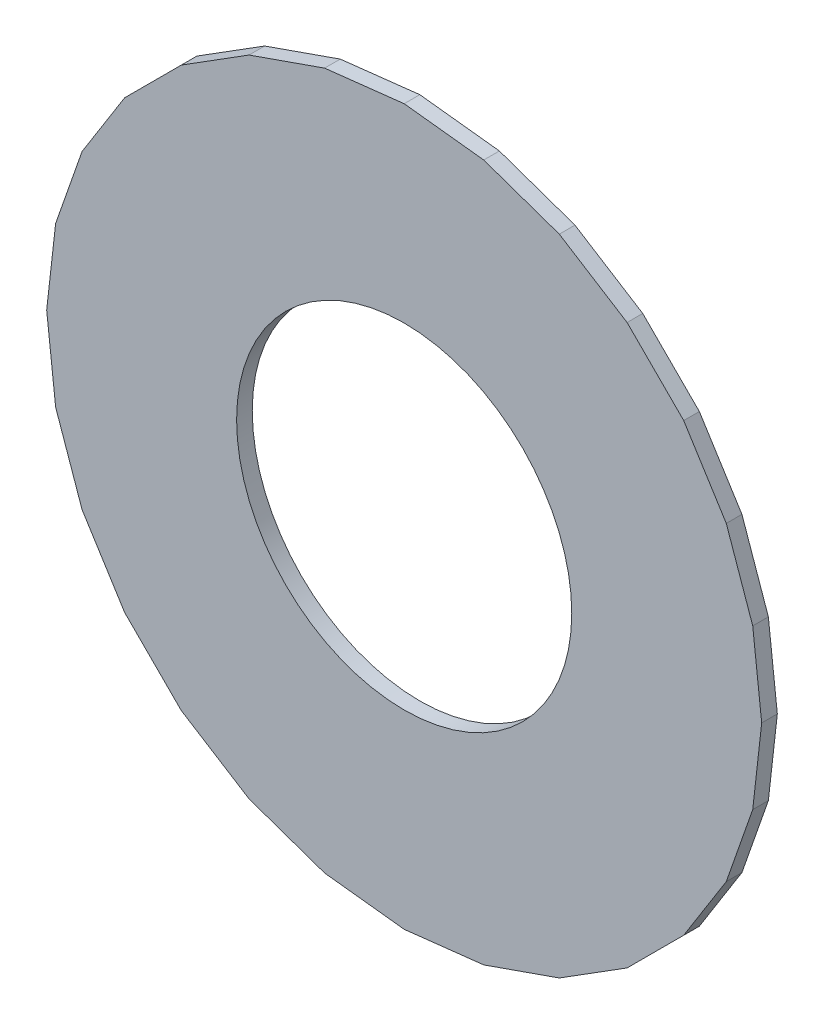
ISO-10303-21;
HEADER;
FILE_DESCRIPTION(('STEP AP214'),'2;1');
FILE_NAME('part.step','',(''),(''),'','','');
FILE_SCHEMA(('AUTOMOTIVE_DESIGN { 1 0 10303 214 1 1 1 1 }'));
ENDSEC;
DATA;
#1=APPLICATION_CONTEXT('core data for automotive mechanical design processes');
#2=APPLICATION_PROTOCOL_DEFINITION('international standard','automotive_design',2000,#1);
#3=PRODUCT_CONTEXT('',#1,'mechanical');
#4=PRODUCT('Part','Part','',(#3));
#5=PRODUCT_RELATED_PRODUCT_CATEGORY('part','',(#4));
#6=PRODUCT_DEFINITION_FORMATION('','',#4);
#7=PRODUCT_DEFINITION_CONTEXT('part definition',#1,'design');
#8=PRODUCT_DEFINITION('design','',#6,#7);
#9=PRODUCT_DEFINITION_SHAPE('','',#8);
#10=(LENGTH_UNIT() NAMED_UNIT(*) SI_UNIT(.MILLI.,.METRE.));
#11=(NAMED_UNIT(*) PLANE_ANGLE_UNIT() SI_UNIT($,.RADIAN.));
#12=(NAMED_UNIT(*) SI_UNIT($,.STERADIAN.) SOLID_ANGLE_UNIT());
#13=UNCERTAINTY_MEASURE_WITH_UNIT(LENGTH_MEASURE(1.E-05),#10,'distance_accuracy_value','');
#14=(GEOMETRIC_REPRESENTATION_CONTEXT(3) GLOBAL_UNCERTAINTY_ASSIGNED_CONTEXT((#13)) GLOBAL_UNIT_ASSIGNED_CONTEXT((#10,
#11,#12)) REPRESENTATION_CONTEXT('',''));
#15=CARTESIAN_POINT('',(0.,0.,0.));
#16=DIRECTION('',(0.,0.,1.));
#17=DIRECTION('',(1.,0.,0.));
#18=AXIS2_PLACEMENT_3D('',#15,#16,#17);
#19=CARTESIAN_POINT('',(117.856,-127.896,-0.045));
#20=DIRECTION('',(0.,0.,-1.));
#21=DIRECTION('',(0.,-1.,0.));
#22=AXIS2_PLACEMENT_3D('',#19,#20,#21);
#23=CYLINDRICAL_SURFACE('',#22,0.375);
#24=CARTESIAN_POINT('',(117.856,-127.896,1.67));
#25=DIRECTION('',(0.,0.,-1.));
#26=DIRECTION('',(0.,-1.,0.));
#27=AXIS2_PLACEMENT_3D('',#24,#25,#26);
#28=CIRCLE('',#27,0.375);
#29=CARTESIAN_POINT('',(117.856,-128.271,1.67));
#30=VERTEX_POINT('',#29);
#31=EDGE_CURVE('E343',#30,#30,#28,.T.);
#32=ORIENTED_EDGE('',*,*,#31,.T.);
#33=DIRECTION('',(0.,0.,1.));
#34=VECTOR('',#33,1.);
#35=CARTESIAN_POINT('',(117.856,-128.271,-0.045));
#36=LINE('',#35,#34);
#37=CARTESIAN_POINT('',(117.856,-128.271,1.705));
#38=VERTEX_POINT('',#37);
#39=EDGE_CURVE('E11',#30,#38,#36,.T.);
#40=ORIENTED_EDGE('',*,*,#39,.T.);
#41=CARTESIAN_POINT('',(117.856,-127.896,1.705));
#42=DIRECTION('',(0.,0.,-1.));
#43=DIRECTION('',(0.,-1.,0.));
#44=AXIS2_PLACEMENT_3D('',#41,#42,#43);
#45=CIRCLE('',#44,0.375);
#46=EDGE_CURVE('E423',#38,#38,#45,.T.);
#47=ORIENTED_EDGE('',*,*,#46,.F.);
#48=ORIENTED_EDGE('',*,*,#39,.F.);
#49=EDGE_LOOP('',(#32,#40,#47,#48));
#50=FACE_BOUND('',#49,.T.);
#51=ADVANCED_FACE('F17',(#50),#23,.F.);
#52=CARTESIAN_POINT('',(117.677983,-128.675942,1.67));
#53=DIRECTION('',(-0.330278315977027,-0.943883591337077,0.));
#54=DIRECTION('',(-0.943883591337077,0.330278315977027,0.));
#55=AXIS2_PLACEMENT_3D('',#52,#53,#54);
#56=PLANE('',#55);
#57=DIRECTION('',(0.,0.,1.));
#58=VECTOR('',#57,1.);
#59=CARTESIAN_POINT('',(117.677983,-128.675942,1.67));
#60=LINE('',#59,#58);
#61=CARTESIAN_POINT('',(117.677983,-128.675942,1.67));
#62=VERTEX_POINT('',#61);
#63=CARTESIAN_POINT('',(117.677983,-128.675942,1.705));
#64=VERTEX_POINT('',#63);
#65=EDGE_CURVE('E21',#62,#64,#60,.T.);
#66=ORIENTED_EDGE('',*,*,#65,.T.);
#67=DIRECTION('',(-0.943883591337077,0.330278315977027,0.));
#68=VECTOR('',#67,1.);
#69=CARTESIAN_POINT('',(117.677983,-128.675942,1.705));
#70=LINE('',#69,#68);
#71=CARTESIAN_POINT('',(117.508893,-128.616775,1.705));
#72=VERTEX_POINT('',#71);
#73=EDGE_CURVE('E398',#64,#72,#70,.T.);
#74=ORIENTED_EDGE('',*,*,#73,.T.);
#75=DIRECTION('',(0.,0.,1.));
#76=VECTOR('',#75,1.);
#77=CARTESIAN_POINT('',(117.508893,-128.616775,1.67));
#78=LINE('',#77,#76);
#79=CARTESIAN_POINT('',(117.508893,-128.616775,1.67));
#80=VERTEX_POINT('',#79);
#81=EDGE_CURVE('E474',#80,#72,#78,.T.);
#82=ORIENTED_EDGE('',*,*,#81,.F.);
#83=DIRECTION('',(-0.943883591337077,0.330278315977027,0.));
#84=VECTOR('',#83,1.);
#85=CARTESIAN_POINT('',(117.677983,-128.675942,1.67));
#86=LINE('',#85,#84);
#87=EDGE_CURVE('E488',#62,#80,#86,.T.);
#88=ORIENTED_EDGE('',*,*,#87,.F.);
#89=EDGE_LOOP('',(#66,#74,#82,#88));
#90=FACE_BOUND('',#89,.T.);
#91=ADVANCED_FACE('F19',(#90),#56,.T.);
#92=CARTESIAN_POINT('',(117.856,-128.696,1.67));
#93=DIRECTION('',(-0.111966136678988,-0.993712022789894,0.));
#94=DIRECTION('',(-0.993712022789894,0.111966136678988,0.));
#95=AXIS2_PLACEMENT_3D('',#92,#93,#94);
#96=PLANE('',#95);
#97=DIRECTION('',(0.,0.,1.));
#98=VECTOR('',#97,1.);
#99=CARTESIAN_POINT('',(117.856,-128.696,1.67));
#100=LINE('',#99,#98);
#101=CARTESIAN_POINT('',(117.856,-128.696,1.67));
#102=VERTEX_POINT('',#101);
#103=CARTESIAN_POINT('',(117.856,-128.696,1.705));
#104=VERTEX_POINT('',#103);
#105=EDGE_CURVE('E417',#102,#104,#100,.T.);
#106=ORIENTED_EDGE('',*,*,#105,.T.);
#107=DIRECTION('',(-0.993712022789894,0.111966136678988,0.));
#108=VECTOR('',#107,1.);
#109=CARTESIAN_POINT('',(117.856,-128.696,1.705));
#110=LINE('',#109,#108);
#111=EDGE_CURVE('E402',#104,#64,#110,.T.);
#112=ORIENTED_EDGE('',*,*,#111,.T.);
#113=ORIENTED_EDGE('',*,*,#65,.F.);
#114=DIRECTION('',(-0.993712022789894,0.111966136678988,0.));
#115=VECTOR('',#114,1.);
#116=CARTESIAN_POINT('',(117.856,-128.696,1.67));
#117=LINE('',#116,#115);
#118=EDGE_CURVE('E516',#102,#62,#117,.T.);
#119=ORIENTED_EDGE('',*,*,#118,.F.);
#120=EDGE_LOOP('',(#106,#112,#113,#119));
#121=FACE_BOUND('',#120,.T.);
#122=ADVANCED_FACE('F493',(#121),#96,.T.);
#123=CARTESIAN_POINT('',(117.508893,-128.616775,1.67));
#124=DIRECTION('',(-0.532032066600227,-0.846724205458361,0.));
#125=DIRECTION('',(-0.846724205458361,0.532032066600227,0.));
#126=AXIS2_PLACEMENT_3D('',#123,#124,#125);
#127=PLANE('',#126);
#128=ORIENTED_EDGE('',*,*,#81,.T.);
#129=DIRECTION('',(-0.846724205458361,0.532032066600227,0.));
#130=VECTOR('',#129,1.);
#131=CARTESIAN_POINT('',(117.508893,-128.616775,1.705));
#132=LINE('',#131,#130);
#133=CARTESIAN_POINT('',(117.357208,-128.521465,1.705));
#134=VERTEX_POINT('',#133);
#135=EDGE_CURVE('E394',#72,#134,#132,.T.);
#136=ORIENTED_EDGE('',*,*,#135,.T.);
#137=DIRECTION('',(0.,0.,1.));
#138=VECTOR('',#137,1.);
#139=CARTESIAN_POINT('',(117.357208,-128.521465,1.67));
#140=LINE('',#139,#138);
#141=CARTESIAN_POINT('',(117.357208,-128.521465,1.67));
#142=VERTEX_POINT('',#141);
#143=EDGE_CURVE('E406',#142,#134,#140,.T.);
#144=ORIENTED_EDGE('',*,*,#143,.F.);
#145=DIRECTION('',(-0.846724205458361,0.532032066600227,0.));
#146=VECTOR('',#145,1.);
#147=CARTESIAN_POINT('',(117.508893,-128.616775,1.67));
#148=LINE('',#147,#146);
#149=EDGE_CURVE('E504',#80,#142,#148,.T.);
#150=ORIENTED_EDGE('',*,*,#149,.F.);
#151=EDGE_LOOP('',(#128,#136,#144,#150));
#152=FACE_BOUND('',#151,.T.);
#153=ADVANCED_FACE('F501',(#152),#127,.T.);
#154=CARTESIAN_POINT('',(118.034017,-128.675942,1.67));
#155=DIRECTION('',(0.111966136678988,-0.993712022789894,0.));
#156=DIRECTION('',(0.,0.,-1.));
#157=AXIS2_PLACEMENT_3D('',#154,#155,#156);
#158=PLANE('',#157);
#159=DIRECTION('',(0.,0.,1.));
#160=VECTOR('',#159,1.);
#161=CARTESIAN_POINT('',(118.034017,-128.675942,1.67));
#162=LINE('',#161,#160);
#163=CARTESIAN_POINT('',(118.034017,-128.675942,1.67));
#164=VERTEX_POINT('',#163);
#165=CARTESIAN_POINT('',(118.034017,-128.675942,1.705));
#166=VERTEX_POINT('',#165);
#167=EDGE_CURVE('E403',#164,#166,#162,.T.);
#168=ORIENTED_EDGE('',*,*,#167,.T.);
#169=DIRECTION('',(-0.993712022789894,-0.111966136678988,0.));
#170=VECTOR('',#169,1.);
#171=CARTESIAN_POINT('',(118.034017,-128.675942,1.705));
#172=LINE('',#171,#170);
#173=EDGE_CURVE('E319',#166,#104,#172,.T.);
#174=ORIENTED_EDGE('',*,*,#173,.T.);
#175=ORIENTED_EDGE('',*,*,#105,.F.);
#176=DIRECTION('',(-0.993712022789894,-0.111966136678988,0.));
#177=VECTOR('',#176,1.);
#178=CARTESIAN_POINT('',(118.034017,-128.675942,1.67));
#179=LINE('',#178,#177);
#180=EDGE_CURVE('E606',#164,#102,#179,.T.);
#181=ORIENTED_EDGE('',*,*,#180,.F.);
#182=EDGE_LOOP('',(#168,#174,#175,#181));
#183=FACE_BOUND('',#182,.T.);
#184=ADVANCED_FACE('F616',(#183),#158,.T.);
#185=CARTESIAN_POINT('',(117.357208,-128.521465,1.67));
#186=DIRECTION('',(-0.707106781186548,-0.707106781186548,0.));
#187=DIRECTION('',(-0.707106781186548,0.707106781186548,0.));
#188=AXIS2_PLACEMENT_3D('',#185,#186,#187);
#189=PLANE('',#188);
#190=ORIENTED_EDGE('',*,*,#143,.T.);
#191=DIRECTION('',(-0.707106781186548,0.707106781186548,0.));
#192=VECTOR('',#191,1.);
#193=CARTESIAN_POINT('',(117.357208,-128.521465,1.705));
#194=LINE('',#193,#192);
#195=CARTESIAN_POINT('',(117.230535,-128.394792,1.705));
#196=VERTEX_POINT('',#195);
#197=EDGE_CURVE('E383',#134,#196,#194,.T.);
#198=ORIENTED_EDGE('',*,*,#197,.T.);
#199=DIRECTION('',(0.,0.,1.));
#200=VECTOR('',#199,1.);
#201=CARTESIAN_POINT('',(117.230535,-128.394792,1.67));
#202=LINE('',#201,#200);
#203=CARTESIAN_POINT('',(117.230535,-128.394792,1.67));
#204=VERTEX_POINT('',#203);
#205=EDGE_CURVE('E407',#204,#196,#202,.T.);
#206=ORIENTED_EDGE('',*,*,#205,.F.);
#207=DIRECTION('',(-0.707106781186548,0.707106781186548,0.));
#208=VECTOR('',#207,1.);
#209=CARTESIAN_POINT('',(117.357208,-128.521465,1.67));
#210=LINE('',#209,#208);
#211=EDGE_CURVE('E507',#142,#204,#210,.T.);
#212=ORIENTED_EDGE('',*,*,#211,.F.);
#213=EDGE_LOOP('',(#190,#198,#206,#212));
#214=FACE_BOUND('',#213,.T.);
#215=ADVANCED_FACE('F508',(#214),#189,.T.);
#216=CARTESIAN_POINT('',(118.203107,-128.616775,1.67));
#217=DIRECTION('',(0.330278315977027,-0.943883591337077,0.));
#218=DIRECTION('',(0.,0.,-1.));
#219=AXIS2_PLACEMENT_3D('',#216,#217,#218);
#220=PLANE('',#219);
#221=DIRECTION('',(0.,0.,1.));
#222=VECTOR('',#221,1.);
#223=CARTESIAN_POINT('',(118.203107,-128.616775,1.67));
#224=LINE('',#223,#222);
#225=CARTESIAN_POINT('',(118.203107,-128.616775,1.67));
#226=VERTEX_POINT('',#225);
#227=CARTESIAN_POINT('',(118.203107,-128.616775,1.705));
#228=VERTEX_POINT('',#227);
#229=EDGE_CURVE('E468',#226,#228,#224,.T.);
#230=ORIENTED_EDGE('',*,*,#229,.T.);
#231=DIRECTION('',(-0.943883591337077,-0.330278315977027,0.));
#232=VECTOR('',#231,1.);
#233=CARTESIAN_POINT('',(118.203107,-128.616775,1.705));
#234=LINE('',#233,#232);
#235=EDGE_CURVE('E314',#228,#166,#234,.T.);
#236=ORIENTED_EDGE('',*,*,#235,.T.);
#237=ORIENTED_EDGE('',*,*,#167,.F.);
#238=DIRECTION('',(-0.943883591337077,-0.330278315977027,0.));
#239=VECTOR('',#238,1.);
#240=CARTESIAN_POINT('',(118.203107,-128.616775,1.67));
#241=LINE('',#240,#239);
#242=EDGE_CURVE('E551',#226,#164,#241,.T.);
#243=ORIENTED_EDGE('',*,*,#242,.F.);
#244=EDGE_LOOP('',(#230,#236,#237,#243));
#245=FACE_BOUND('',#244,.T.);
#246=ADVANCED_FACE('F621',(#245),#220,.T.);
#247=CARTESIAN_POINT('',(117.230535,-128.394792,1.67));
#248=DIRECTION('',(-0.846724205458361,-0.532032066600227,0.));
#249=DIRECTION('',(-0.532032066600227,0.846724205458361,0.));
#250=AXIS2_PLACEMENT_3D('',#247,#248,#249);
#251=PLANE('',#250);
#252=ORIENTED_EDGE('',*,*,#205,.T.);
#253=DIRECTION('',(-0.532032066600227,0.846724205458361,0.));
#254=VECTOR('',#253,1.);
#255=CARTESIAN_POINT('',(117.230535,-128.394792,1.705));
#256=LINE('',#255,#254);
#257=CARTESIAN_POINT('',(117.135225,-128.243107,1.705));
#258=VERTEX_POINT('',#257);
#259=EDGE_CURVE('E379',#196,#258,#256,.T.);
#260=ORIENTED_EDGE('',*,*,#259,.T.);
#261=DIRECTION('',(0.,0.,1.));
#262=VECTOR('',#261,1.);
#263=CARTESIAN_POINT('',(117.135225,-128.243107,1.67));
#264=LINE('',#263,#262);
#265=CARTESIAN_POINT('',(117.135225,-128.243107,1.67));
#266=VERTEX_POINT('',#265);
#267=EDGE_CURVE('E465',#266,#258,#264,.T.);
#268=ORIENTED_EDGE('',*,*,#267,.F.);
#269=DIRECTION('',(-0.532032066600227,0.846724205458361,0.));
#270=VECTOR('',#269,1.);
#271=CARTESIAN_POINT('',(117.230535,-128.394792,1.67));
#272=LINE('',#271,#270);
#273=EDGE_CURVE('E310',#204,#266,#272,.T.);
#274=ORIENTED_EDGE('',*,*,#273,.F.);
#275=EDGE_LOOP('',(#252,#260,#268,#274));
#276=FACE_BOUND('',#275,.T.);
#277=ADVANCED_FACE('F1115',(#276),#251,.T.);
#278=CARTESIAN_POINT('',(118.354792,-128.521465,1.67));
#279=DIRECTION('',(0.532032066600227,-0.846724205458361,0.));
#280=DIRECTION('',(0.,0.,-1.));
#281=AXIS2_PLACEMENT_3D('',#278,#279,#280);
#282=PLANE('',#281);
#283=DIRECTION('',(0.,0.,1.));
#284=VECTOR('',#283,1.);
#285=CARTESIAN_POINT('',(118.354792,-128.521465,1.67));
#286=LINE('',#285,#284);
#287=CARTESIAN_POINT('',(118.354792,-128.521465,1.67));
#288=VERTEX_POINT('',#287);
#289=CARTESIAN_POINT('',(118.354792,-128.521465,1.705));
#290=VERTEX_POINT('',#289);
#291=EDGE_CURVE('E462',#288,#290,#286,.T.);
#292=ORIENTED_EDGE('',*,*,#291,.T.);
#293=DIRECTION('',(-0.846724205458361,-0.532032066600227,0.));
#294=VECTOR('',#293,1.);
#295=CARTESIAN_POINT('',(118.354792,-128.521465,1.705));
#296=LINE('',#295,#294);
#297=EDGE_CURVE('E318',#290,#228,#296,.T.);
#298=ORIENTED_EDGE('',*,*,#297,.T.);
#299=ORIENTED_EDGE('',*,*,#229,.F.);
#300=DIRECTION('',(-0.846724205458361,-0.532032066600227,0.));
#301=VECTOR('',#300,1.);
#302=CARTESIAN_POINT('',(118.354792,-128.521465,1.67));
#303=LINE('',#302,#301);
#304=EDGE_CURVE('E547',#288,#226,#303,.T.);
#305=ORIENTED_EDGE('',*,*,#304,.F.);
#306=EDGE_LOOP('',(#292,#298,#299,#305));
#307=FACE_BOUND('',#306,.T.);
#308=ADVANCED_FACE('F624',(#307),#282,.T.);
#309=CARTESIAN_POINT('',(117.135225,-128.243107,1.67));
#310=DIRECTION('',(-0.943883591337077,-0.330278315977027,0.));
#311=DIRECTION('',(-0.330278315977027,0.943883591337077,0.));
#312=AXIS2_PLACEMENT_3D('',#309,#310,#311);
#313=PLANE('',#312);
#314=ORIENTED_EDGE('',*,*,#267,.T.);
#315=DIRECTION('',(-0.330278315977027,0.943883591337077,0.));
#316=VECTOR('',#315,1.);
#317=CARTESIAN_POINT('',(117.135225,-128.243107,1.705));
#318=LINE('',#317,#316);
#319=CARTESIAN_POINT('',(117.076058,-128.074017,1.705));
#320=VERTEX_POINT('',#319);
#321=EDGE_CURVE('E349',#258,#320,#318,.T.);
#322=ORIENTED_EDGE('',*,*,#321,.T.);
#323=DIRECTION('',(0.,0.,1.));
#324=VECTOR('',#323,1.);
#325=CARTESIAN_POINT('',(117.076058,-128.074017,1.67));
#326=LINE('',#325,#324);
#327=CARTESIAN_POINT('',(117.076058,-128.074017,1.67));
#328=VERTEX_POINT('',#327);
#329=EDGE_CURVE('E459',#328,#320,#326,.T.);
#330=ORIENTED_EDGE('',*,*,#329,.F.);
#331=DIRECTION('',(-0.330278315977027,0.943883591337077,0.));
#332=VECTOR('',#331,1.);
#333=CARTESIAN_POINT('',(117.135225,-128.243107,1.67));
#334=LINE('',#333,#332);
#335=EDGE_CURVE('E303',#266,#328,#334,.T.);
#336=ORIENTED_EDGE('',*,*,#335,.F.);
#337=EDGE_LOOP('',(#314,#322,#330,#336));
#338=FACE_BOUND('',#337,.T.);
#339=ADVANCED_FACE('F949',(#338),#313,.T.);
#340=CARTESIAN_POINT('',(118.481465,-128.394792,1.67));
#341=DIRECTION('',(0.707106781186548,-0.707106781186548,0.));
#342=DIRECTION('',(0.,0.,-1.));
#343=AXIS2_PLACEMENT_3D('',#340,#341,#342);
#344=PLANE('',#343);
#345=DIRECTION('',(0.,0.,1.));
#346=VECTOR('',#345,1.);
#347=CARTESIAN_POINT('',(118.481465,-128.394792,1.67));
#348=LINE('',#347,#346);
#349=CARTESIAN_POINT('',(118.481465,-128.394792,1.67));
#350=VERTEX_POINT('',#349);
#351=CARTESIAN_POINT('',(118.481465,-128.394792,1.705));
#352=VERTEX_POINT('',#351);
#353=EDGE_CURVE('E286',#350,#352,#348,.T.);
#354=ORIENTED_EDGE('',*,*,#353,.T.);
#355=DIRECTION('',(-0.707106781186548,-0.707106781186548,0.));
#356=VECTOR('',#355,1.);
#357=CARTESIAN_POINT('',(118.481465,-128.394792,1.705));
#358=LINE('',#357,#356);
#359=EDGE_CURVE('E370',#352,#290,#358,.T.);
#360=ORIENTED_EDGE('',*,*,#359,.T.);
#361=ORIENTED_EDGE('',*,*,#291,.F.);
#362=DIRECTION('',(-0.707106781186548,-0.707106781186548,0.));
#363=VECTOR('',#362,1.);
#364=CARTESIAN_POINT('',(118.481465,-128.394792,1.67));
#365=LINE('',#364,#363);
#366=EDGE_CURVE('E552',#350,#288,#365,.T.);
#367=ORIENTED_EDGE('',*,*,#366,.F.);
#368=EDGE_LOOP('',(#354,#360,#361,#367));
#369=FACE_BOUND('',#368,.T.);
#370=ADVANCED_FACE('F627',(#369),#344,.T.);
#371=CARTESIAN_POINT('',(117.076058,-128.074017,1.67));
#372=DIRECTION('',(-0.993712022789894,-0.111966136678988,0.));
#373=DIRECTION('',(-0.111966136678988,0.993712022789894,0.));
#374=AXIS2_PLACEMENT_3D('',#371,#372,#373);
#375=PLANE('',#374);
#376=ORIENTED_EDGE('',*,*,#329,.T.);
#377=DIRECTION('',(-0.111966136678988,0.993712022789894,0.));
#378=VECTOR('',#377,1.);
#379=CARTESIAN_POINT('',(117.076058,-128.074017,1.705));
#380=LINE('',#379,#378);
#381=CARTESIAN_POINT('',(117.056,-127.896,1.705));
#382=VERTEX_POINT('',#381);
#383=EDGE_CURVE('E281',#320,#382,#380,.T.);
#384=ORIENTED_EDGE('',*,*,#383,.T.);
#385=DIRECTION('',(0.,0.,1.));
#386=VECTOR('',#385,1.);
#387=CARTESIAN_POINT('',(117.056,-127.896,1.67));
#388=LINE('',#387,#386);
#389=CARTESIAN_POINT('',(117.056,-127.896,1.67));
#390=VERTEX_POINT('',#389);
#391=EDGE_CURVE('E274',#390,#382,#388,.T.);
#392=ORIENTED_EDGE('',*,*,#391,.F.);
#393=DIRECTION('',(-0.111966136678988,0.993712022789894,0.));
#394=VECTOR('',#393,1.);
#395=CARTESIAN_POINT('',(117.076058,-128.074017,1.67));
#396=LINE('',#395,#394);
#397=EDGE_CURVE('E278',#328,#390,#396,.T.);
#398=ORIENTED_EDGE('',*,*,#397,.F.);
#399=EDGE_LOOP('',(#376,#384,#392,#398));
#400=FACE_BOUND('',#399,.T.);
#401=ADVANCED_FACE('F276',(#400),#375,.T.);
#402=CARTESIAN_POINT('',(118.576775,-128.243107,1.67));
#403=DIRECTION('',(0.846724205458361,-0.532032066600227,0.));
#404=DIRECTION('',(0.,0.,-1.));
#405=AXIS2_PLACEMENT_3D('',#402,#403,#404);
#406=PLANE('',#405);
#407=DIRECTION('',(0.,0.,1.));
#408=VECTOR('',#407,1.);
#409=CARTESIAN_POINT('',(118.576775,-128.243107,1.67));
#410=LINE('',#409,#408);
#411=CARTESIAN_POINT('',(118.576775,-128.243107,1.67));
#412=VERTEX_POINT('',#411);
#413=CARTESIAN_POINT('',(118.576775,-128.243107,1.705));
#414=VERTEX_POINT('',#413);
#415=EDGE_CURVE('E287',#412,#414,#410,.T.);
#416=ORIENTED_EDGE('',*,*,#415,.T.);
#417=DIRECTION('',(-0.532032066600227,-0.846724205458361,0.));
#418=VECTOR('',#417,1.);
#419=CARTESIAN_POINT('',(118.576775,-128.243107,1.705));
#420=LINE('',#419,#418);
#421=EDGE_CURVE('E411',#414,#352,#420,.T.);
#422=ORIENTED_EDGE('',*,*,#421,.T.);
#423=ORIENTED_EDGE('',*,*,#353,.F.);
#424=DIRECTION('',(-0.532032066600227,-0.846724205458361,0.));
#425=VECTOR('',#424,1.);
#426=CARTESIAN_POINT('',(118.576775,-128.243107,1.67));
#427=LINE('',#426,#425);
#428=EDGE_CURVE('E573',#412,#350,#427,.T.);
#429=ORIENTED_EDGE('',*,*,#428,.F.);
#430=EDGE_LOOP('',(#416,#422,#423,#429));
#431=FACE_BOUND('',#430,.T.);
#432=ADVANCED_FACE('F632',(#431),#406,.T.);
#433=CARTESIAN_POINT('',(117.056,-127.896,1.67));
#434=DIRECTION('',(-0.993712022789894,0.111966136678988,0.));
#435=DIRECTION('',(0.,0.,1.));
#436=AXIS2_PLACEMENT_3D('',#433,#434,#435);
#437=PLANE('',#436);
#438=ORIENTED_EDGE('',*,*,#391,.T.);
#439=DIRECTION('',(0.111966136678988,0.993712022789894,0.));
#440=VECTOR('',#439,1.);
#441=CARTESIAN_POINT('',(117.056,-127.896,1.705));
#442=LINE('',#441,#440);
#443=CARTESIAN_POINT('',(117.076058,-127.717983,1.705));
#444=VERTEX_POINT('',#443);
#445=EDGE_CURVE('E350',#382,#444,#442,.T.);
#446=ORIENTED_EDGE('',*,*,#445,.T.);
#447=DIRECTION('',(0.,0.,1.));
#448=VECTOR('',#447,1.);
#449=CARTESIAN_POINT('',(117.076058,-127.717983,1.67));
#450=LINE('',#449,#448);
#451=CARTESIAN_POINT('',(117.076058,-127.717983,1.67));
#452=VERTEX_POINT('',#451);
#453=EDGE_CURVE('E292',#452,#444,#450,.T.);
#454=ORIENTED_EDGE('',*,*,#453,.F.);
#455=DIRECTION('',(0.111966136678988,0.993712022789894,0.));
#456=VECTOR('',#455,1.);
#457=CARTESIAN_POINT('',(117.056,-127.896,1.67));
#458=LINE('',#457,#456);
#459=EDGE_CURVE('E290',#390,#452,#458,.T.);
#460=ORIENTED_EDGE('',*,*,#459,.F.);
#461=EDGE_LOOP('',(#438,#446,#454,#460));
#462=FACE_BOUND('',#461,.T.);
#463=ADVANCED_FACE('F291',(#462),#437,.T.);
#464=CARTESIAN_POINT('',(118.635942,-128.074017,1.67));
#465=DIRECTION('',(0.943883591337077,-0.330278315977027,0.));
#466=DIRECTION('',(0.,0.,-1.));
#467=AXIS2_PLACEMENT_3D('',#464,#465,#466);
#468=PLANE('',#467);
#469=DIRECTION('',(0.,0.,1.));
#470=VECTOR('',#469,1.);
#471=CARTESIAN_POINT('',(118.635942,-128.074017,1.67));
#472=LINE('',#471,#470);
#473=CARTESIAN_POINT('',(118.635942,-128.074017,1.67));
#474=VERTEX_POINT('',#473);
#475=CARTESIAN_POINT('',(118.635942,-128.074017,1.705));
#476=VERTEX_POINT('',#475);
#477=EDGE_CURVE('E452',#474,#476,#472,.T.);
#478=ORIENTED_EDGE('',*,*,#477,.T.);
#479=DIRECTION('',(-0.330278315977027,-0.943883591337077,0.));
#480=VECTOR('',#479,1.);
#481=CARTESIAN_POINT('',(118.635942,-128.074017,1.705));
#482=LINE('',#481,#480);
#483=EDGE_CURVE('E427',#476,#414,#482,.T.);
#484=ORIENTED_EDGE('',*,*,#483,.T.);
#485=ORIENTED_EDGE('',*,*,#415,.F.);
#486=DIRECTION('',(-0.330278315977027,-0.943883591337077,0.));
#487=VECTOR('',#486,1.);
#488=CARTESIAN_POINT('',(118.635942,-128.074017,1.67));
#489=LINE('',#488,#487);
#490=EDGE_CURVE('E545',#474,#412,#489,.T.);
#491=ORIENTED_EDGE('',*,*,#490,.F.);
#492=EDGE_LOOP('',(#478,#484,#485,#491));
#493=FACE_BOUND('',#492,.T.);
#494=ADVANCED_FACE('F636',(#493),#468,.T.);
#495=CARTESIAN_POINT('',(117.076058,-127.717983,1.67));
#496=DIRECTION('',(-0.943883591337077,0.330278315977027,0.));
#497=DIRECTION('',(0.,0.,1.));
#498=AXIS2_PLACEMENT_3D('',#495,#496,#497);
#499=PLANE('',#498);
#500=ORIENTED_EDGE('',*,*,#453,.T.);
#501=DIRECTION('',(0.330278315977027,0.943883591337077,0.));
#502=VECTOR('',#501,1.);
#503=CARTESIAN_POINT('',(117.076058,-127.717983,1.705));
#504=LINE('',#503,#502);
#505=CARTESIAN_POINT('',(117.135225,-127.548893,1.705));
#506=VERTEX_POINT('',#505);
#507=EDGE_CURVE('E366',#444,#506,#504,.T.);
#508=ORIENTED_EDGE('',*,*,#507,.T.);
#509=DIRECTION('',(0.,0.,1.));
#510=VECTOR('',#509,1.);
#511=CARTESIAN_POINT('',(117.135225,-127.548893,1.67));
#512=LINE('',#511,#510);
#513=CARTESIAN_POINT('',(117.135225,-127.548893,1.67));
#514=VERTEX_POINT('',#513);
#515=EDGE_CURVE('E387',#514,#506,#512,.T.);
#516=ORIENTED_EDGE('',*,*,#515,.F.);
#517=DIRECTION('',(0.330278315977027,0.943883591337077,0.));
#518=VECTOR('',#517,1.);
#519=CARTESIAN_POINT('',(117.076058,-127.717983,1.67));
#520=LINE('',#519,#518);
#521=EDGE_CURVE('E297',#452,#514,#520,.T.);
#522=ORIENTED_EDGE('',*,*,#521,.F.);
#523=EDGE_LOOP('',(#500,#508,#516,#522));
#524=FACE_BOUND('',#523,.T.);
#525=ADVANCED_FACE('F693',(#524),#499,.T.);
#526=CARTESIAN_POINT('',(118.656,-127.896,1.67));
#527=DIRECTION('',(0.993712022789894,-0.111966136678988,0.));
#528=DIRECTION('',(0.,0.,-1.));
#529=AXIS2_PLACEMENT_3D('',#526,#527,#528);
#530=PLANE('',#529);
#531=DIRECTION('',(0.,0.,1.));
#532=VECTOR('',#531,1.);
#533=CARTESIAN_POINT('',(118.656,-127.896,1.67));
#534=LINE('',#533,#532);
#535=CARTESIAN_POINT('',(118.656,-127.896,1.67));
#536=VERTEX_POINT('',#535);
#537=CARTESIAN_POINT('',(118.656,-127.896,1.705));
#538=VERTEX_POINT('',#537);
#539=EDGE_CURVE('E384',#536,#538,#534,.T.);
#540=ORIENTED_EDGE('',*,*,#539,.T.);
#541=DIRECTION('',(-0.111966136678988,-0.993712022789894,0.));
#542=VECTOR('',#541,1.);
#543=CARTESIAN_POINT('',(118.656,-127.896,1.705));
#544=LINE('',#543,#542);
#545=EDGE_CURVE('E431',#538,#476,#544,.T.);
#546=ORIENTED_EDGE('',*,*,#545,.T.);
#547=ORIENTED_EDGE('',*,*,#477,.F.);
#548=DIRECTION('',(-0.111966136678988,-0.993712022789894,0.));
#549=VECTOR('',#548,1.);
#550=CARTESIAN_POINT('',(118.656,-127.896,1.67));
#551=LINE('',#550,#549);
#552=EDGE_CURVE('E541',#536,#474,#551,.T.);
#553=ORIENTED_EDGE('',*,*,#552,.F.);
#554=EDGE_LOOP('',(#540,#546,#547,#553));
#555=FACE_BOUND('',#554,.T.);
#556=ADVANCED_FACE('F639',(#555),#530,.T.);
#557=CARTESIAN_POINT('',(117.135225,-127.548893,1.67));
#558=DIRECTION('',(-0.846724205458361,0.532032066600227,0.));
#559=DIRECTION('',(0.,0.,1.));
#560=AXIS2_PLACEMENT_3D('',#557,#558,#559);
#561=PLANE('',#560);
#562=ORIENTED_EDGE('',*,*,#515,.T.);
#563=DIRECTION('',(0.532032066600227,0.846724205458361,0.));
#564=VECTOR('',#563,1.);
#565=CARTESIAN_POINT('',(117.135225,-127.548893,1.705));
#566=LINE('',#565,#564);
#567=CARTESIAN_POINT('',(117.230535,-127.397208,1.705));
#568=VERTEX_POINT('',#567);
#569=EDGE_CURVE('E362',#506,#568,#566,.T.);
#570=ORIENTED_EDGE('',*,*,#569,.T.);
#571=DIRECTION('',(0.,0.,1.));
#572=VECTOR('',#571,1.);
#573=CARTESIAN_POINT('',(117.230535,-127.397208,1.67));
#574=LINE('',#573,#572);
#575=CARTESIAN_POINT('',(117.230535,-127.397208,1.67));
#576=VERTEX_POINT('',#575);
#577=EDGE_CURVE('E388',#576,#568,#574,.T.);
#578=ORIENTED_EDGE('',*,*,#577,.F.);
#579=DIRECTION('',(0.532032066600227,0.846724205458361,0.));
#580=VECTOR('',#579,1.);
#581=CARTESIAN_POINT('',(117.135225,-127.548893,1.67));
#582=LINE('',#581,#580);
#583=EDGE_CURVE('E322',#514,#576,#582,.T.);
#584=ORIENTED_EDGE('',*,*,#583,.F.);
#585=EDGE_LOOP('',(#562,#570,#578,#584));
#586=FACE_BOUND('',#585,.T.);
#587=ADVANCED_FACE('F690',(#586),#561,.T.);
#588=CARTESIAN_POINT('',(118.635942,-127.717983,1.67));
#589=DIRECTION('',(0.993712022789894,0.111966136678988,0.));
#590=DIRECTION('',(0.,0.,-1.));
#591=AXIS2_PLACEMENT_3D('',#588,#589,#590);
#592=PLANE('',#591);
#593=DIRECTION('',(0.,0.,1.));
#594=VECTOR('',#593,1.);
#595=CARTESIAN_POINT('',(118.635942,-127.717983,1.67));
#596=LINE('',#595,#594);
#597=CARTESIAN_POINT('',(118.635942,-127.717983,1.67));
#598=VERTEX_POINT('',#597);
#599=CARTESIAN_POINT('',(118.635942,-127.717983,1.705));
#600=VERTEX_POINT('',#599);
#601=EDGE_CURVE('E441',#598,#600,#596,.T.);
#602=ORIENTED_EDGE('',*,*,#601,.T.);
#603=DIRECTION('',(0.111966136678988,-0.993712022789894,0.));
#604=VECTOR('',#603,1.);
#605=CARTESIAN_POINT('',(118.635942,-127.717983,1.705));
#606=LINE('',#605,#604);
#607=EDGE_CURVE('E435',#600,#538,#606,.T.);
#608=ORIENTED_EDGE('',*,*,#607,.T.);
#609=ORIENTED_EDGE('',*,*,#539,.F.);
#610=DIRECTION('',(0.111966136678988,-0.993712022789894,0.));
#611=VECTOR('',#610,1.);
#612=CARTESIAN_POINT('',(118.635942,-127.717983,1.67));
#613=LINE('',#612,#611);
#614=EDGE_CURVE('E546',#598,#536,#613,.T.);
#615=ORIENTED_EDGE('',*,*,#614,.F.);
#616=EDGE_LOOP('',(#602,#608,#609,#615));
#617=FACE_BOUND('',#616,.T.);
#618=ADVANCED_FACE('F644',(#617),#592,.T.);
#619=CARTESIAN_POINT('',(117.230535,-127.397208,1.67));
#620=DIRECTION('',(-0.707106781186548,0.707106781186548,0.));
#621=DIRECTION('',(0.,0.,1.));
#622=AXIS2_PLACEMENT_3D('',#619,#620,#621);
#623=PLANE('',#622);
#624=ORIENTED_EDGE('',*,*,#577,.T.);
#625=DIRECTION('',(0.707106781186548,0.707106781186548,0.));
#626=VECTOR('',#625,1.);
#627=CARTESIAN_POINT('',(117.230535,-127.397208,1.705));
#628=LINE('',#627,#626);
#629=CARTESIAN_POINT('',(117.357208,-127.270535,1.705));
#630=VERTEX_POINT('',#629);
#631=EDGE_CURVE('E361',#568,#630,#628,.T.);
#632=ORIENTED_EDGE('',*,*,#631,.T.);
#633=DIRECTION('',(0.,0.,1.));
#634=VECTOR('',#633,1.);
#635=CARTESIAN_POINT('',(117.357208,-127.270535,1.67));
#636=LINE('',#635,#634);
#637=CARTESIAN_POINT('',(117.357208,-127.270535,1.67));
#638=VERTEX_POINT('',#637);
#639=EDGE_CURVE('E392',#638,#630,#636,.T.);
#640=ORIENTED_EDGE('',*,*,#639,.F.);
#641=DIRECTION('',(0.707106781186548,0.707106781186548,0.));
#642=VECTOR('',#641,1.);
#643=CARTESIAN_POINT('',(117.230535,-127.397208,1.67));
#644=LINE('',#643,#642);
#645=EDGE_CURVE('E326',#576,#638,#644,.T.);
#646=ORIENTED_EDGE('',*,*,#645,.F.);
#647=EDGE_LOOP('',(#624,#632,#640,#646));
#648=FACE_BOUND('',#647,.T.);
#649=ADVANCED_FACE('F687',(#648),#623,.T.);
#650=CARTESIAN_POINT('',(118.576775,-127.548893,1.67));
#651=DIRECTION('',(0.943883591337077,0.330278315977027,0.));
#652=DIRECTION('',(0.,0.,-1.));
#653=AXIS2_PLACEMENT_3D('',#650,#651,#652);
#654=PLANE('',#653);
#655=DIRECTION('',(0.,0.,1.));
#656=VECTOR('',#655,1.);
#657=CARTESIAN_POINT('',(118.576775,-127.548893,1.67));
#658=LINE('',#657,#656);
#659=CARTESIAN_POINT('',(118.576775,-127.548893,1.67));
#660=VERTEX_POINT('',#659);
#661=CARTESIAN_POINT('',(118.576775,-127.548893,1.705));
#662=VERTEX_POINT('',#661);
#663=EDGE_CURVE('E389',#660,#662,#658,.T.);
#664=ORIENTED_EDGE('',*,*,#663,.T.);
#665=DIRECTION('',(0.330278315977027,-0.943883591337077,0.));
#666=VECTOR('',#665,1.);
#667=CARTESIAN_POINT('',(118.576775,-127.548893,1.705));
#668=LINE('',#667,#666);
#669=EDGE_CURVE('E336',#662,#600,#668,.T.);
#670=ORIENTED_EDGE('',*,*,#669,.T.);
#671=ORIENTED_EDGE('',*,*,#601,.F.);
#672=DIRECTION('',(0.330278315977027,-0.943883591337077,0.));
#673=VECTOR('',#672,1.);
#674=CARTESIAN_POINT('',(118.576775,-127.548893,1.67));
#675=LINE('',#674,#673);
#676=EDGE_CURVE('E584',#660,#598,#675,.T.);
#677=ORIENTED_EDGE('',*,*,#676,.F.);
#678=EDGE_LOOP('',(#664,#670,#671,#677));
#679=FACE_BOUND('',#678,.T.);
#680=ADVANCED_FACE('F649',(#679),#654,.T.);
#681=CARTESIAN_POINT('',(117.357208,-127.270535,1.67));
#682=DIRECTION('',(-0.532032066600227,0.846724205458361,0.));
#683=DIRECTION('',(0.,0.,1.));
#684=AXIS2_PLACEMENT_3D('',#681,#682,#683);
#685=PLANE('',#684);
#686=ORIENTED_EDGE('',*,*,#639,.T.);
#687=DIRECTION('',(0.846724205458361,0.532032066600227,0.));
#688=VECTOR('',#687,1.);
#689=CARTESIAN_POINT('',(117.357208,-127.270535,1.705));
#690=LINE('',#689,#688);
#691=CARTESIAN_POINT('',(117.508893,-127.175225,1.705));
#692=VERTEX_POINT('',#691);
#693=EDGE_CURVE('E357',#630,#692,#690,.T.);
#694=ORIENTED_EDGE('',*,*,#693,.T.);
#695=DIRECTION('',(0.,0.,1.));
#696=VECTOR('',#695,1.);
#697=CARTESIAN_POINT('',(117.508893,-127.175225,1.67));
#698=LINE('',#697,#696);
#699=CARTESIAN_POINT('',(117.508893,-127.175225,1.67));
#700=VERTEX_POINT('',#699);
#701=EDGE_CURVE('E393',#700,#692,#698,.T.);
#702=ORIENTED_EDGE('',*,*,#701,.F.);
#703=DIRECTION('',(0.846724205458361,0.532032066600227,0.));
#704=VECTOR('',#703,1.);
#705=CARTESIAN_POINT('',(117.357208,-127.270535,1.67));
#706=LINE('',#705,#704);
#707=EDGE_CURVE('E327',#638,#700,#706,.T.);
#708=ORIENTED_EDGE('',*,*,#707,.F.);
#709=EDGE_LOOP('',(#686,#694,#702,#708));
#710=FACE_BOUND('',#709,.T.);
#711=ADVANCED_FACE('F683',(#710),#685,.T.);
#712=CARTESIAN_POINT('',(118.481465,-127.397208,1.67));
#713=DIRECTION('',(0.846724205458361,0.532032066600227,0.));
#714=DIRECTION('',(0.,0.,-1.));
#715=AXIS2_PLACEMENT_3D('',#712,#713,#714);
#716=PLANE('',#715);
#717=DIRECTION('',(0.,0.,1.));
#718=VECTOR('',#717,1.);
#719=CARTESIAN_POINT('',(118.481465,-127.397208,1.67));
#720=LINE('',#719,#718);
#721=CARTESIAN_POINT('',(118.481465,-127.397208,1.67));
#722=VERTEX_POINT('',#721);
#723=CARTESIAN_POINT('',(118.481465,-127.397208,1.705));
#724=VERTEX_POINT('',#723);
#725=EDGE_CURVE('E47',#722,#724,#720,.T.);
#726=ORIENTED_EDGE('',*,*,#725,.T.);
#727=DIRECTION('',(0.532032066600227,-0.846724205458361,0.));
#728=VECTOR('',#727,1.);
#729=CARTESIAN_POINT('',(118.481465,-127.397208,1.705));
#730=LINE('',#729,#728);
#731=EDGE_CURVE('E332',#724,#662,#730,.T.);
#732=ORIENTED_EDGE('',*,*,#731,.T.);
#733=ORIENTED_EDGE('',*,*,#663,.F.);
#734=DIRECTION('',(0.532032066600227,-0.846724205458361,0.));
#735=VECTOR('',#734,1.);
#736=CARTESIAN_POINT('',(118.481465,-127.397208,1.67));
#737=LINE('',#736,#735);
#738=EDGE_CURVE('E580',#722,#660,#737,.T.);
#739=ORIENTED_EDGE('',*,*,#738,.F.);
#740=EDGE_LOOP('',(#726,#732,#733,#739));
#741=FACE_BOUND('',#740,.T.);
#742=ADVANCED_FACE('F650',(#741),#716,.T.);
#743=CARTESIAN_POINT('',(117.508893,-127.175225,1.67));
#744=DIRECTION('',(-0.330278315977027,0.943883591337077,0.));
#745=DIRECTION('',(0.,0.,1.));
#746=AXIS2_PLACEMENT_3D('',#743,#744,#745);
#747=PLANE('',#746);
#748=ORIENTED_EDGE('',*,*,#701,.T.);
#749=DIRECTION('',(0.943883591337077,0.330278315977027,0.));
#750=VECTOR('',#749,1.);
#751=CARTESIAN_POINT('',(117.508893,-127.175225,1.705));
#752=LINE('',#751,#750);
#753=CARTESIAN_POINT('',(117.677983,-127.116058,1.705));
#754=VERTEX_POINT('',#753);
#755=EDGE_CURVE('E353',#692,#754,#752,.T.);
#756=ORIENTED_EDGE('',*,*,#755,.T.);
#757=DIRECTION('',(0.,0.,1.));
#758=VECTOR('',#757,1.);
#759=CARTESIAN_POINT('',(117.677983,-127.116058,1.67));
#760=LINE('',#759,#758);
#761=CARTESIAN_POINT('',(117.677983,-127.116058,1.67));
#762=VERTEX_POINT('',#761);
#763=EDGE_CURVE('E438',#762,#754,#760,.T.);
#764=ORIENTED_EDGE('',*,*,#763,.F.);
#765=DIRECTION('',(0.943883591337077,0.330278315977027,0.));
#766=VECTOR('',#765,1.);
#767=CARTESIAN_POINT('',(117.508893,-127.175225,1.67));
#768=LINE('',#767,#766);
#769=EDGE_CURVE('E331',#700,#762,#768,.T.);
#770=ORIENTED_EDGE('',*,*,#769,.F.);
#771=EDGE_LOOP('',(#748,#756,#764,#770));
#772=FACE_BOUND('',#771,.T.);
#773=ADVANCED_FACE('F678',(#772),#747,.T.);
#774=CARTESIAN_POINT('',(118.354792,-127.270535,1.67));
#775=DIRECTION('',(0.707106781186548,0.707106781186548,0.));
#776=DIRECTION('',(0.,0.,-1.));
#777=AXIS2_PLACEMENT_3D('',#774,#775,#776);
#778=PLANE('',#777);
#779=DIRECTION('',(0.,0.,1.));
#780=VECTOR('',#779,1.);
#781=CARTESIAN_POINT('',(118.354792,-127.270535,1.67));
#782=LINE('',#781,#780);
#783=CARTESIAN_POINT('',(118.354792,-127.270535,1.67));
#784=VERTEX_POINT('',#783);
#785=CARTESIAN_POINT('',(118.354792,-127.270535,1.705));
#786=VERTEX_POINT('',#785);
#787=EDGE_CURVE('E559',#784,#786,#782,.T.);
#788=ORIENTED_EDGE('',*,*,#787,.T.);
#789=DIRECTION('',(0.707106781186548,-0.707106781186548,0.));
#790=VECTOR('',#789,1.);
#791=CARTESIAN_POINT('',(118.354792,-127.270535,1.705));
#792=LINE('',#791,#790);
#793=EDGE_CURVE('E335',#786,#724,#792,.T.);
#794=ORIENTED_EDGE('',*,*,#793,.T.);
#795=ORIENTED_EDGE('',*,*,#725,.F.);
#796=DIRECTION('',(0.707106781186548,-0.707106781186548,0.));
#797=VECTOR('',#796,1.);
#798=CARTESIAN_POINT('',(118.354792,-127.270535,1.67));
#799=LINE('',#798,#797);
#800=EDGE_CURVE('E569',#784,#722,#799,.T.);
#801=ORIENTED_EDGE('',*,*,#800,.F.);
#802=EDGE_LOOP('',(#788,#794,#795,#801));
#803=FACE_BOUND('',#802,.T.);
#804=ADVANCED_FACE('F654',(#803),#778,.T.);
#805=CARTESIAN_POINT('',(117.677983,-127.116058,1.67));
#806=DIRECTION('',(-0.111966136678988,0.993712022789894,0.));
#807=DIRECTION('',(0.,0.,1.));
#808=AXIS2_PLACEMENT_3D('',#805,#806,#807);
#809=PLANE('',#808);
#810=ORIENTED_EDGE('',*,*,#763,.T.);
#811=DIRECTION('',(0.993712022789894,0.111966136678988,0.));
#812=VECTOR('',#811,1.);
#813=CARTESIAN_POINT('',(117.677983,-127.116058,1.705));
#814=LINE('',#813,#812);
#815=CARTESIAN_POINT('',(117.856,-127.096,1.705));
#816=VERTEX_POINT('',#815);
#817=EDGE_CURVE('E346',#754,#816,#814,.T.);
#818=ORIENTED_EDGE('',*,*,#817,.T.);
#819=DIRECTION('',(0.,0.,1.));
#820=VECTOR('',#819,1.);
#821=CARTESIAN_POINT('',(117.856,-127.096,1.67));
#822=LINE('',#821,#820);
#823=CARTESIAN_POINT('',(117.856,-127.096,1.67));
#824=VERTEX_POINT('',#823);
#825=EDGE_CURVE('E531',#824,#816,#822,.T.);
#826=ORIENTED_EDGE('',*,*,#825,.F.);
#827=DIRECTION('',(0.993712022789894,0.111966136678988,0.));
#828=VECTOR('',#827,1.);
#829=CARTESIAN_POINT('',(117.677983,-127.116058,1.67));
#830=LINE('',#829,#828);
#831=EDGE_CURVE('E340',#762,#824,#830,.T.);
#832=ORIENTED_EDGE('',*,*,#831,.F.);
#833=EDGE_LOOP('',(#810,#818,#826,#832));
#834=FACE_BOUND('',#833,.T.);
#835=ADVANCED_FACE('F675',(#834),#809,.T.);
#836=CARTESIAN_POINT('',(0.,0.,1.705));
#837=DIRECTION('',(0.,0.,1.));
#838=DIRECTION('',(1.,0.,0.));
#839=AXIS2_PLACEMENT_3D('',#836,#837,#838);
#840=PLANE('',#839);
#841=ORIENTED_EDGE('',*,*,#46,.T.);
#842=EDGE_LOOP('',(#841));
#843=FACE_BOUND('',#842,.T.);
#844=DIRECTION('',(0.943883591337077,-0.330278315977027,0.));
#845=VECTOR('',#844,1.);
#846=CARTESIAN_POINT('',(118.034017,-127.116058,1.705));
#847=LINE('',#846,#845);
#848=CARTESIAN_POINT('',(118.034017,-127.116058,1.705));
#849=VERTEX_POINT('',#848);
#850=CARTESIAN_POINT('',(118.203107,-127.175225,1.705));
#851=VERTEX_POINT('',#850);
#852=EDGE_CURVE('E522',#849,#851,#847,.T.);
#853=ORIENTED_EDGE('',*,*,#852,.F.);
#854=DIRECTION('',(0.993712022789894,-0.111966136678988,0.));
#855=VECTOR('',#854,1.);
#856=CARTESIAN_POINT('',(117.856,-127.096,1.705));
#857=LINE('',#856,#855);
#858=EDGE_CURVE('E535',#816,#849,#857,.T.);
#859=ORIENTED_EDGE('',*,*,#858,.F.);
#860=ORIENTED_EDGE('',*,*,#817,.F.);
#861=ORIENTED_EDGE('',*,*,#755,.F.);
#862=ORIENTED_EDGE('',*,*,#693,.F.);
#863=ORIENTED_EDGE('',*,*,#631,.F.);
#864=ORIENTED_EDGE('',*,*,#569,.F.);
#865=ORIENTED_EDGE('',*,*,#507,.F.);
#866=ORIENTED_EDGE('',*,*,#445,.F.);
#867=ORIENTED_EDGE('',*,*,#383,.F.);
#868=ORIENTED_EDGE('',*,*,#321,.F.);
#869=ORIENTED_EDGE('',*,*,#259,.F.);
#870=ORIENTED_EDGE('',*,*,#197,.F.);
#871=ORIENTED_EDGE('',*,*,#135,.F.);
#872=ORIENTED_EDGE('',*,*,#73,.F.);
#873=ORIENTED_EDGE('',*,*,#111,.F.);
#874=ORIENTED_EDGE('',*,*,#173,.F.);
#875=ORIENTED_EDGE('',*,*,#235,.F.);
#876=ORIENTED_EDGE('',*,*,#297,.F.);
#877=ORIENTED_EDGE('',*,*,#359,.F.);
#878=ORIENTED_EDGE('',*,*,#421,.F.);
#879=ORIENTED_EDGE('',*,*,#483,.F.);
#880=ORIENTED_EDGE('',*,*,#545,.F.);
#881=ORIENTED_EDGE('',*,*,#607,.F.);
#882=ORIENTED_EDGE('',*,*,#669,.F.);
#883=ORIENTED_EDGE('',*,*,#731,.F.);
#884=ORIENTED_EDGE('',*,*,#793,.F.);
#885=DIRECTION('',(0.846724205458361,-0.532032066600227,0.));
#886=VECTOR('',#885,1.);
#887=CARTESIAN_POINT('',(118.203107,-127.175225,1.705));
#888=LINE('',#887,#886);
#889=EDGE_CURVE('E555',#851,#786,#888,.T.);
#890=ORIENTED_EDGE('',*,*,#889,.F.);
#891=EDGE_LOOP('',(#853,#859,#860,#861,#862,#863,#864,#865,#866,#867,#868,#869,#870,#871,#872,
#873,#874,#875,#876,#877,#878,#879,#880,#881,#882,#883,#884,#890));
#892=FACE_BOUND('',#891,.T.);
#893=ADVANCED_FACE('F497',(#843,#892),#840,.T.);
#894=CARTESIAN_POINT('',(0.,0.,1.67));
#895=DIRECTION('',(0.,0.,1.));
#896=DIRECTION('',(1.,0.,0.));
#897=AXIS2_PLACEMENT_3D('',#894,#895,#896);
#898=PLANE('',#897);
#899=ORIENTED_EDGE('',*,*,#31,.F.);
#900=EDGE_LOOP('',(#899));
#901=FACE_BOUND('',#900,.T.);
#902=DIRECTION('',(0.846724205458361,-0.532032066600227,0.));
#903=VECTOR('',#902,1.);
#904=CARTESIAN_POINT('',(118.203107,-127.175225,1.67));
#905=LINE('',#904,#903);
#906=CARTESIAN_POINT('',(118.203107,-127.175225,1.67));
#907=VERTEX_POINT('',#906);
#908=EDGE_CURVE('E566',#907,#784,#905,.T.);
#909=ORIENTED_EDGE('',*,*,#908,.T.);
#910=ORIENTED_EDGE('',*,*,#800,.T.);
#911=ORIENTED_EDGE('',*,*,#738,.T.);
#912=ORIENTED_EDGE('',*,*,#676,.T.);
#913=ORIENTED_EDGE('',*,*,#614,.T.);
#914=ORIENTED_EDGE('',*,*,#552,.T.);
#915=ORIENTED_EDGE('',*,*,#490,.T.);
#916=ORIENTED_EDGE('',*,*,#428,.T.);
#917=ORIENTED_EDGE('',*,*,#366,.T.);
#918=ORIENTED_EDGE('',*,*,#304,.T.);
#919=ORIENTED_EDGE('',*,*,#242,.T.);
#920=ORIENTED_EDGE('',*,*,#180,.T.);
#921=ORIENTED_EDGE('',*,*,#118,.T.);
#922=ORIENTED_EDGE('',*,*,#87,.T.);
#923=ORIENTED_EDGE('',*,*,#149,.T.);
#924=ORIENTED_EDGE('',*,*,#211,.T.);
#925=ORIENTED_EDGE('',*,*,#273,.T.);
#926=ORIENTED_EDGE('',*,*,#335,.T.);
#927=ORIENTED_EDGE('',*,*,#397,.T.);
#928=ORIENTED_EDGE('',*,*,#459,.T.);
#929=ORIENTED_EDGE('',*,*,#521,.T.);
#930=ORIENTED_EDGE('',*,*,#583,.T.);
#931=ORIENTED_EDGE('',*,*,#645,.T.);
#932=ORIENTED_EDGE('',*,*,#707,.T.);
#933=ORIENTED_EDGE('',*,*,#769,.T.);
#934=ORIENTED_EDGE('',*,*,#831,.T.);
#935=DIRECTION('',(0.993712022789894,-0.111966136678988,0.));
#936=VECTOR('',#935,1.);
#937=CARTESIAN_POINT('',(117.856,-127.096,1.67));
#938=LINE('',#937,#936);
#939=CARTESIAN_POINT('',(118.034017,-127.116058,1.67));
#940=VERTEX_POINT('',#939);
#941=EDGE_CURVE('E540',#824,#940,#938,.T.);
#942=ORIENTED_EDGE('',*,*,#941,.T.);
#943=DIRECTION('',(0.943883591337077,-0.330278315977027,0.));
#944=VECTOR('',#943,1.);
#945=CARTESIAN_POINT('',(118.034017,-127.116058,1.67));
#946=LINE('',#945,#944);
#947=EDGE_CURVE('E520',#940,#907,#946,.T.);
#948=ORIENTED_EDGE('',*,*,#947,.T.);
#949=EDGE_LOOP('',(#909,#910,#911,#912,#913,#914,#915,#916,#917,#918,#919,#920,#921,#922,#923,
#924,#925,#926,#927,#928,#929,#930,#931,#932,#933,#934,#942,#948));
#950=FACE_BOUND('',#949,.T.);
#951=ADVANCED_FACE('F300',(#901,#950),#898,.F.);
#952=CARTESIAN_POINT('',(118.203107,-127.175225,1.67));
#953=DIRECTION('',(0.532032066600227,0.846724205458361,0.));
#954=DIRECTION('',(0.,0.,-1.));
#955=AXIS2_PLACEMENT_3D('',#952,#953,#954);
#956=PLANE('',#955);
#957=DIRECTION('',(0.,0.,1.));
#958=VECTOR('',#957,1.);
#959=CARTESIAN_POINT('',(118.203107,-127.175225,1.67));
#960=LINE('',#959,#958);
#961=EDGE_CURVE('E526',#907,#851,#960,.T.);
#962=ORIENTED_EDGE('',*,*,#961,.T.);
#963=ORIENTED_EDGE('',*,*,#889,.T.);
#964=ORIENTED_EDGE('',*,*,#787,.F.);
#965=ORIENTED_EDGE('',*,*,#908,.F.);
#966=EDGE_LOOP('',(#962,#963,#964,#965));
#967=FACE_BOUND('',#966,.T.);
#968=ADVANCED_FACE('F658',(#967),#956,.T.);
#969=CARTESIAN_POINT('',(117.856,-127.096,1.67));
#970=DIRECTION('',(0.111966136678988,0.993712022789894,0.));
#971=DIRECTION('',(0.,0.,-1.));
#972=AXIS2_PLACEMENT_3D('',#969,#970,#971);
#973=PLANE('',#972);
#974=ORIENTED_EDGE('',*,*,#825,.T.);
#975=ORIENTED_EDGE('',*,*,#858,.T.);
#976=DIRECTION('',(0.,0.,1.));
#977=VECTOR('',#976,1.);
#978=CARTESIAN_POINT('',(118.034017,-127.116058,1.67));
#979=LINE('',#978,#977);
#980=EDGE_CURVE('E527',#940,#849,#979,.T.);
#981=ORIENTED_EDGE('',*,*,#980,.F.);
#982=ORIENTED_EDGE('',*,*,#941,.F.);
#983=EDGE_LOOP('',(#974,#975,#981,#982));
#984=FACE_BOUND('',#983,.T.);
#985=ADVANCED_FACE('F672',(#984),#973,.T.);
#986=CARTESIAN_POINT('',(118.034017,-127.116058,1.67));
#987=DIRECTION('',(0.330278315977027,0.943883591337077,0.));
#988=DIRECTION('',(0.,0.,-1.));
#989=AXIS2_PLACEMENT_3D('',#986,#987,#988);
#990=PLANE('',#989);
#991=ORIENTED_EDGE('',*,*,#980,.T.);
#992=ORIENTED_EDGE('',*,*,#852,.T.);
#993=ORIENTED_EDGE('',*,*,#961,.F.);
#994=ORIENTED_EDGE('',*,*,#947,.F.);
#995=EDGE_LOOP('',(#991,#992,#993,#994));
#996=FACE_BOUND('',#995,.T.);
#997=ADVANCED_FACE('F664',(#996),#990,.T.);
#998=CLOSED_SHELL('',(#51,#91,#122,#153,#184,#215,#246,#277,#308,#339,#370,#401,#432,#463,#494,
#525,#556,#587,#618,#649,#680,#711,#742,#773,#804,#835,#893,#951,#968,#985,#997));
#999=MANIFOLD_SOLID_BREP('B1',#998);
#1000=ADVANCED_BREP_SHAPE_REPRESENTATION('',(#18,#999),#14);
#1001=SHAPE_DEFINITION_REPRESENTATION(#9,#1000);
ENDSEC;
END-ISO-10303-21;
